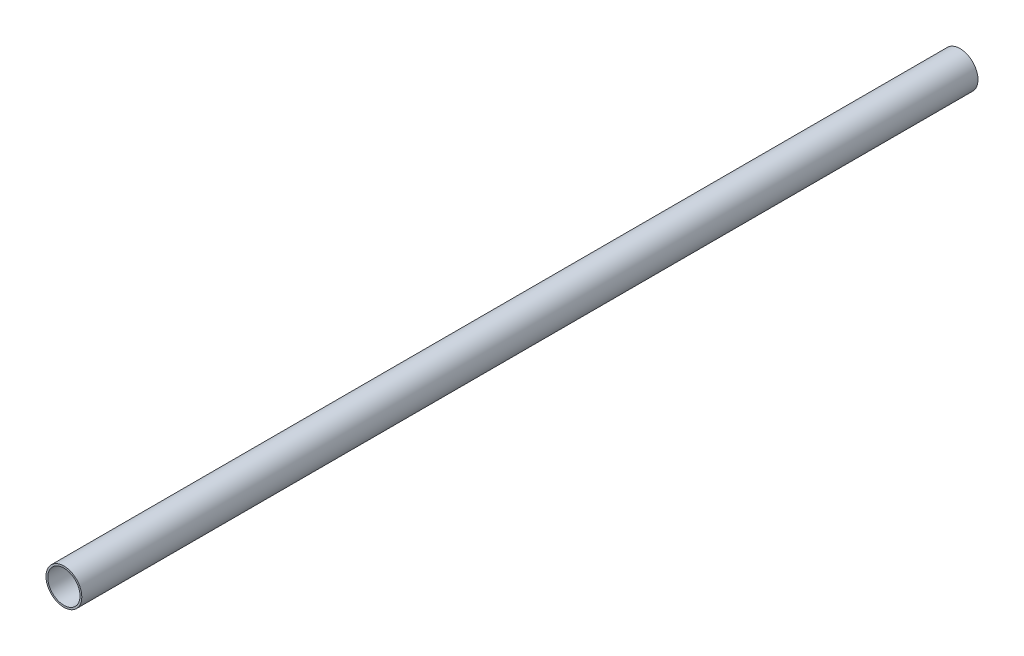
ISO-10303-21;
HEADER;
FILE_DESCRIPTION(('STEP AP214'),'2;1');
FILE_NAME('part.step','',(''),(''),'','','');
FILE_SCHEMA(('AUTOMOTIVE_DESIGN { 1 0 10303 214 1 1 1 1 }'));
ENDSEC;
DATA;
#1=APPLICATION_CONTEXT('core data for automotive mechanical design processes');
#2=APPLICATION_PROTOCOL_DEFINITION('international standard','automotive_design',2000,#1);
#3=PRODUCT_CONTEXT('',#1,'mechanical');
#4=PRODUCT('Part','Part','',(#3));
#5=PRODUCT_RELATED_PRODUCT_CATEGORY('part','',(#4));
#6=PRODUCT_DEFINITION_FORMATION('','',#4);
#7=PRODUCT_DEFINITION_CONTEXT('part definition',#1,'design');
#8=PRODUCT_DEFINITION('design','',#6,#7);
#9=PRODUCT_DEFINITION_SHAPE('','',#8);
#10=(LENGTH_UNIT() NAMED_UNIT(*) SI_UNIT(.MILLI.,.METRE.));
#11=(NAMED_UNIT(*) PLANE_ANGLE_UNIT() SI_UNIT($,.RADIAN.));
#12=(NAMED_UNIT(*) SI_UNIT($,.STERADIAN.) SOLID_ANGLE_UNIT());
#13=UNCERTAINTY_MEASURE_WITH_UNIT(LENGTH_MEASURE(1.E-05),#10,'distance_accuracy_value','');
#14=(GEOMETRIC_REPRESENTATION_CONTEXT(3) GLOBAL_UNCERTAINTY_ASSIGNED_CONTEXT((#13)) GLOBAL_UNIT_ASSIGNED_CONTEXT((#10,
#11,#12)) REPRESENTATION_CONTEXT('',''));
#15=CARTESIAN_POINT('',(0.,0.,0.));
#16=DIRECTION('',(0.,0.,1.));
#17=DIRECTION('',(1.,0.,0.));
#18=AXIS2_PLACEMENT_3D('',#15,#16,#17);
#19=CARTESIAN_POINT('',(0.,0.,500.));
#20=DIRECTION('',(0.,0.,1.));
#21=DIRECTION('',(1.,0.,0.));
#22=AXIS2_PLACEMENT_3D('',#19,#20,#21);
#23=PLANE('',#22);
#24=CARTESIAN_POINT('',(0.,0.,500.));
#25=DIRECTION('',(0.,0.,1.));
#26=DIRECTION('',(1.,0.,0.));
#27=AXIS2_PLACEMENT_3D('',#24,#25,#26);
#28=CIRCLE('',#27,10.);
#29=CARTESIAN_POINT('',(10.,0.,500.));
#30=VERTEX_POINT('',#29);
#31=EDGE_CURVE('E10',#30,#30,#28,.T.);
#32=ORIENTED_EDGE('',*,*,#31,.T.);
#33=EDGE_LOOP('',(#32));
#34=FACE_BOUND('',#33,.T.);
#35=CARTESIAN_POINT('',(0.,0.,500.));
#36=DIRECTION('',(0.,0.,1.));
#37=DIRECTION('',(1.,0.,0.));
#38=AXIS2_PLACEMENT_3D('',#35,#36,#37);
#39=CIRCLE('',#38,9.);
#40=CARTESIAN_POINT('',(9.,0.,500.));
#41=VERTEX_POINT('',#40);
#42=EDGE_CURVE('E50',#41,#41,#39,.T.);
#43=ORIENTED_EDGE('',*,*,#42,.F.);
#44=EDGE_LOOP('',(#43));
#45=FACE_BOUND('',#44,.T.);
#46=ADVANCED_FACE('F37',(#34,#45),#23,.T.);
#47=CARTESIAN_POINT('',(0.,0.,0.));
#48=DIRECTION('',(0.,0.,1.));
#49=DIRECTION('',(1.,0.,0.));
#50=AXIS2_PLACEMENT_3D('',#47,#48,#49);
#51=PLANE('',#50);
#52=CARTESIAN_POINT('',(0.,0.,0.));
#53=DIRECTION('',(0.,0.,1.));
#54=DIRECTION('',(1.,0.,0.));
#55=AXIS2_PLACEMENT_3D('',#52,#53,#54);
#56=CIRCLE('',#55,10.);
#57=CARTESIAN_POINT('',(10.,0.,0.));
#58=VERTEX_POINT('',#57);
#59=EDGE_CURVE('E41',#58,#58,#56,.T.);
#60=ORIENTED_EDGE('',*,*,#59,.F.);
#61=EDGE_LOOP('',(#60));
#62=FACE_BOUND('',#61,.T.);
#63=CARTESIAN_POINT('',(0.,0.,0.));
#64=DIRECTION('',(0.,0.,1.));
#65=DIRECTION('',(1.,0.,0.));
#66=AXIS2_PLACEMENT_3D('',#63,#64,#65);
#67=CIRCLE('',#66,9.);
#68=CARTESIAN_POINT('',(9.,0.,0.));
#69=VERTEX_POINT('',#68);
#70=EDGE_CURVE('E52',#69,#69,#67,.T.);
#71=ORIENTED_EDGE('',*,*,#70,.T.);
#72=EDGE_LOOP('',(#71));
#73=FACE_BOUND('',#72,.T.);
#74=ADVANCED_FACE('F64',(#62,#73),#51,.F.);
#75=CARTESIAN_POINT('',(0.,0.,500.));
#76=DIRECTION('',(0.,0.,-1.));
#77=DIRECTION('',(-1.,0.,0.));
#78=AXIS2_PLACEMENT_3D('',#75,#76,#77);
#79=CYLINDRICAL_SURFACE('',#78,10.);
#80=ORIENTED_EDGE('',*,*,#31,.F.);
#81=EDGE_LOOP('',(#80));
#82=FACE_BOUND('',#81,.T.);
#83=ORIENTED_EDGE('',*,*,#59,.T.);
#84=EDGE_LOOP('',(#83));
#85=FACE_BOUND('',#84,.T.);
#86=ADVANCED_FACE('F39',(#82,#85),#79,.T.);
#87=CARTESIAN_POINT('',(0.,0.,500.));
#88=DIRECTION('',(0.,0.,-1.));
#89=DIRECTION('',(-1.,0.,0.));
#90=AXIS2_PLACEMENT_3D('',#87,#88,#89);
#91=CYLINDRICAL_SURFACE('',#90,9.);
#92=ORIENTED_EDGE('',*,*,#42,.T.);
#93=EDGE_LOOP('',(#92));
#94=FACE_BOUND('',#93,.T.);
#95=ORIENTED_EDGE('',*,*,#70,.F.);
#96=EDGE_LOOP('',(#95));
#97=FACE_BOUND('',#96,.T.);
#98=ADVANCED_FACE('F60',(#94,#97),#91,.F.);
#99=CLOSED_SHELL('',(#46,#74,#86,#98));
#100=MANIFOLD_SOLID_BREP('B2',#99);
#101=ADVANCED_BREP_SHAPE_REPRESENTATION('',(#18,#100),#14);
#102=SHAPE_DEFINITION_REPRESENTATION(#9,#101);
ENDSEC;
END-ISO-10303-21;
